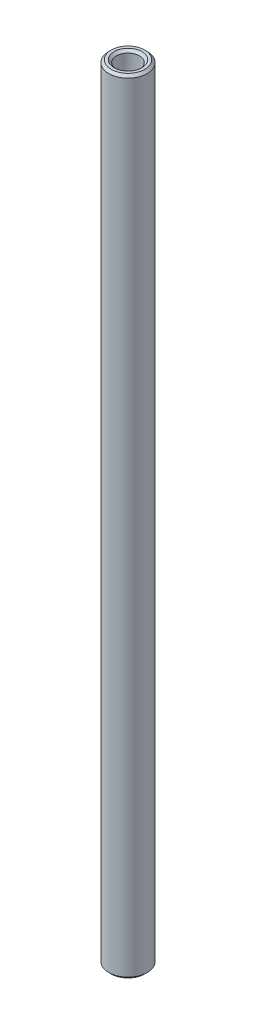
ISO-10303-21;
HEADER;
FILE_DESCRIPTION(('STEP AP214'),'2;1');
FILE_NAME('part.step','',(''),(''),'','','');
FILE_SCHEMA(('AUTOMOTIVE_DESIGN { 1 0 10303 214 1 1 1 1 }'));
ENDSEC;
DATA;
#1=APPLICATION_CONTEXT('core data for automotive mechanical design processes');
#2=APPLICATION_PROTOCOL_DEFINITION('international standard','automotive_design',2000,#1);
#3=PRODUCT_CONTEXT('',#1,'mechanical');
#4=PRODUCT('Part','Part','',(#3));
#5=PRODUCT_RELATED_PRODUCT_CATEGORY('part','',(#4));
#6=PRODUCT_DEFINITION_FORMATION('','',#4);
#7=PRODUCT_DEFINITION_CONTEXT('part definition',#1,'design');
#8=PRODUCT_DEFINITION('design','',#6,#7);
#9=PRODUCT_DEFINITION_SHAPE('','',#8);
#10=(LENGTH_UNIT() NAMED_UNIT(*) SI_UNIT(.MILLI.,.METRE.));
#11=(NAMED_UNIT(*) PLANE_ANGLE_UNIT() SI_UNIT($,.RADIAN.));
#12=(NAMED_UNIT(*) SI_UNIT($,.STERADIAN.) SOLID_ANGLE_UNIT());
#13=UNCERTAINTY_MEASURE_WITH_UNIT(LENGTH_MEASURE(1.E-05),#10,'distance_accuracy_value','');
#14=(GEOMETRIC_REPRESENTATION_CONTEXT(3) GLOBAL_UNCERTAINTY_ASSIGNED_CONTEXT((#13)) GLOBAL_UNIT_ASSIGNED_CONTEXT((#10,
#11,#12)) REPRESENTATION_CONTEXT('',''));
#15=CARTESIAN_POINT('',(0.,0.,0.));
#16=DIRECTION('',(0.,0.,1.));
#17=DIRECTION('',(1.,0.,0.));
#18=AXIS2_PLACEMENT_3D('',#15,#16,#17);
#19=CARTESIAN_POINT('',(0.,40.48125,0.));
#20=DIRECTION('',(0.,1.,0.));
#21=DIRECTION('',(0.,0.,1.));
#22=AXIS2_PLACEMENT_3D('',#19,#20,#21);
#23=PLANE('',#22);
#24=CARTESIAN_POINT('',(0.,40.48125,0.));
#25=DIRECTION('',(0.,1.,0.));
#26=DIRECTION('',(0.,0.,1.));
#27=AXIS2_PLACEMENT_3D('',#24,#25,#26);
#28=CIRCLE('',#27,1.444625);
#29=CARTESIAN_POINT('',(0.,40.48125,1.444625));
#30=VERTEX_POINT('',#29);
#31=EDGE_CURVE('E10',#30,#30,#28,.F.);
#32=ORIENTED_EDGE('',*,*,#31,.T.);
#33=EDGE_LOOP('',(#32));
#34=FACE_BOUND('',#33,.T.);
#35=CARTESIAN_POINT('',(0.,40.48125,0.));
#36=DIRECTION('',(0.,1.,0.));
#37=DIRECTION('',(0.,0.,1.));
#38=AXIS2_PLACEMENT_3D('',#35,#36,#37);
#39=CIRCLE('',#38,1.73037499999998);
#40=CARTESIAN_POINT('',(0.,40.48125,1.73037499999998));
#41=VERTEX_POINT('',#40);
#42=EDGE_CURVE('E41',#41,#41,#39,.T.);
#43=ORIENTED_EDGE('',*,*,#42,.T.);
#44=EDGE_LOOP('',(#43));
#45=FACE_BOUND('',#44,.T.);
#46=ADVANCED_FACE('F33',(#34,#45),#23,.T.);
#47=CARTESIAN_POINT('',(0.,-40.48125,0.));
#48=DIRECTION('',(0.,1.,0.));
#49=DIRECTION('',(0.,0.,1.));
#50=AXIS2_PLACEMENT_3D('',#47,#48,#49);
#51=PLANE('',#50);
#52=CARTESIAN_POINT('',(0.,-40.48125,0.));
#53=DIRECTION('',(0.,1.,0.));
#54=DIRECTION('',(0.,0.,1.));
#55=AXIS2_PLACEMENT_3D('',#52,#53,#54);
#56=CIRCLE('',#55,1.444625);
#57=CARTESIAN_POINT('',(0.,-40.48125,1.444625));
#58=VERTEX_POINT('',#57);
#59=EDGE_CURVE('E60',#58,#58,#56,.T.);
#60=ORIENTED_EDGE('',*,*,#59,.T.);
#61=EDGE_LOOP('',(#60));
#62=FACE_BOUND('',#61,.T.);
#63=CARTESIAN_POINT('',(0.,-40.48125,0.));
#64=DIRECTION('',(0.,1.,0.));
#65=DIRECTION('',(0.,0.,1.));
#66=AXIS2_PLACEMENT_3D('',#63,#64,#65);
#67=CIRCLE('',#66,1.73037499999999);
#68=CARTESIAN_POINT('',(0.,-40.48125,1.73037499999999));
#69=VERTEX_POINT('',#68);
#70=EDGE_CURVE('E63',#69,#69,#67,.F.);
#71=ORIENTED_EDGE('',*,*,#70,.T.);
#72=EDGE_LOOP('',(#71));
#73=FACE_BOUND('',#72,.T.);
#74=ADVANCED_FACE('F67',(#62,#73),#51,.F.);
#75=CARTESIAN_POINT('',(0.,40.48125,0.));
#76=DIRECTION('',(0.,-1.,0.));
#77=DIRECTION('',(0.,0.,-1.));
#78=AXIS2_PLACEMENT_3D('',#75,#76,#77);
#79=CYLINDRICAL_SURFACE('',#78,1.984375);
#80=CARTESIAN_POINT('',(0.,-40.22725,0.));
#81=DIRECTION('',(0.,1.,0.));
#82=DIRECTION('',(0.,0.,1.));
#83=AXIS2_PLACEMENT_3D('',#80,#81,#82);
#84=CIRCLE('',#83,1.984375);
#85=CARTESIAN_POINT('',(0.,-40.22725,1.984375));
#86=VERTEX_POINT('',#85);
#87=EDGE_CURVE('E45',#86,#86,#84,.T.);
#88=ORIENTED_EDGE('',*,*,#87,.T.);
#89=EDGE_LOOP('',(#88));
#90=FACE_BOUND('',#89,.T.);
#91=CARTESIAN_POINT('',(0.,40.22725,0.));
#92=DIRECTION('',(0.,1.,0.));
#93=DIRECTION('',(0.,0.,1.));
#94=AXIS2_PLACEMENT_3D('',#91,#92,#93);
#95=CIRCLE('',#94,1.984375);
#96=CARTESIAN_POINT('',(0.,40.22725,1.984375));
#97=VERTEX_POINT('',#96);
#98=EDGE_CURVE('E49',#97,#97,#95,.F.);
#99=ORIENTED_EDGE('',*,*,#98,.T.);
#100=EDGE_LOOP('',(#99));
#101=FACE_BOUND('',#100,.T.);
#102=ADVANCED_FACE('F77',(#90,#101),#79,.T.);
#103=CARTESIAN_POINT('',(0.,40.48125,0.));
#104=DIRECTION('',(0.,-1.,0.));
#105=DIRECTION('',(0.,0.,-1.));
#106=AXIS2_PLACEMENT_3D('',#103,#104,#105);
#107=CYLINDRICAL_SURFACE('',#106,1.190625);
#108=CARTESIAN_POINT('',(0.,-40.22725,0.));
#109=DIRECTION('',(0.,1.,0.));
#110=DIRECTION('',(0.,0.,1.));
#111=AXIS2_PLACEMENT_3D('',#108,#109,#110);
#112=CIRCLE('',#111,1.190625);
#113=CARTESIAN_POINT('',(0.,-40.22725,1.190625));
#114=VERTEX_POINT('',#113);
#115=EDGE_CURVE('E54',#114,#114,#112,.F.);
#116=ORIENTED_EDGE('',*,*,#115,.T.);
#117=EDGE_LOOP('',(#116));
#118=FACE_BOUND('',#117,.T.);
#119=CARTESIAN_POINT('',(0.,40.22725,0.));
#120=DIRECTION('',(0.,1.,0.));
#121=DIRECTION('',(0.,0.,1.));
#122=AXIS2_PLACEMENT_3D('',#119,#120,#121);
#123=CIRCLE('',#122,1.190625);
#124=CARTESIAN_POINT('',(0.,40.22725,1.190625));
#125=VERTEX_POINT('',#124);
#126=EDGE_CURVE('E57',#125,#125,#123,.T.);
#127=ORIENTED_EDGE('',*,*,#126,.T.);
#128=EDGE_LOOP('',(#127));
#129=FACE_BOUND('',#128,.T.);
#130=ADVANCED_FACE('F80',(#118,#129),#107,.F.);
#131=CARTESIAN_POINT('',(0.,-40.48125,0.));
#132=DIRECTION('',(0.,-1.,0.));
#133=DIRECTION('',(0.,0.,-1.));
#134=AXIS2_PLACEMENT_3D('',#131,#132,#133);
#135=CONICAL_SURFACE('',#134,1.444625,0.78539816339745);
#136=ORIENTED_EDGE('',*,*,#115,.F.);
#137=EDGE_LOOP('',(#136));
#138=FACE_BOUND('',#137,.T.);
#139=ORIENTED_EDGE('',*,*,#59,.F.);
#140=EDGE_LOOP('',(#139));
#141=FACE_BOUND('',#140,.T.);
#142=ADVANCED_FACE('F73',(#138,#141),#135,.F.);
#143=CARTESIAN_POINT('',(0.,-40.22725,0.));
#144=DIRECTION('',(0.,1.,0.));
#145=DIRECTION('',(0.,0.,1.));
#146=AXIS2_PLACEMENT_3D('',#143,#144,#145);
#147=CONICAL_SURFACE('',#146,1.984375,0.785398163397455);
#148=ORIENTED_EDGE('',*,*,#70,.F.);
#149=EDGE_LOOP('',(#148));
#150=FACE_BOUND('',#149,.T.);
#151=ORIENTED_EDGE('',*,*,#87,.F.);
#152=EDGE_LOOP('',(#151));
#153=FACE_BOUND('',#152,.T.);
#154=ADVANCED_FACE('F69',(#150,#153),#147,.T.);
#155=CARTESIAN_POINT('',(0.,40.22725,0.));
#156=DIRECTION('',(0.,1.,0.));
#157=DIRECTION('',(0.,0.,1.));
#158=AXIS2_PLACEMENT_3D('',#155,#156,#157);
#159=CONICAL_SURFACE('',#158,1.190625,0.78539816339745);
#160=ORIENTED_EDGE('',*,*,#31,.F.);
#161=EDGE_LOOP('',(#160));
#162=FACE_BOUND('',#161,.T.);
#163=ORIENTED_EDGE('',*,*,#126,.F.);
#164=EDGE_LOOP('',(#163));
#165=FACE_BOUND('',#164,.T.);
#166=ADVANCED_FACE('F72',(#162,#165),#159,.F.);
#167=CARTESIAN_POINT('',(0.,40.48125,0.));
#168=DIRECTION('',(0.,-1.,0.));
#169=DIRECTION('',(0.,0.,-1.));
#170=AXIS2_PLACEMENT_3D('',#167,#168,#169);
#171=CONICAL_SURFACE('',#170,1.73037499999998,0.785398163397442);
#172=ORIENTED_EDGE('',*,*,#98,.F.);
#173=EDGE_LOOP('',(#172));
#174=FACE_BOUND('',#173,.T.);
#175=ORIENTED_EDGE('',*,*,#42,.F.);
#176=EDGE_LOOP('',(#175));
#177=FACE_BOUND('',#176,.T.);
#178=ADVANCED_FACE('F36',(#174,#177),#171,.T.);
#179=CLOSED_SHELL('',(#46,#74,#102,#130,#142,#154,#166,#178));
#180=MANIFOLD_SOLID_BREP('B2',#179);
#181=ADVANCED_BREP_SHAPE_REPRESENTATION('',(#18,#180),#14);
#182=SHAPE_DEFINITION_REPRESENTATION(#9,#181);
ENDSEC;
END-ISO-10303-21;
